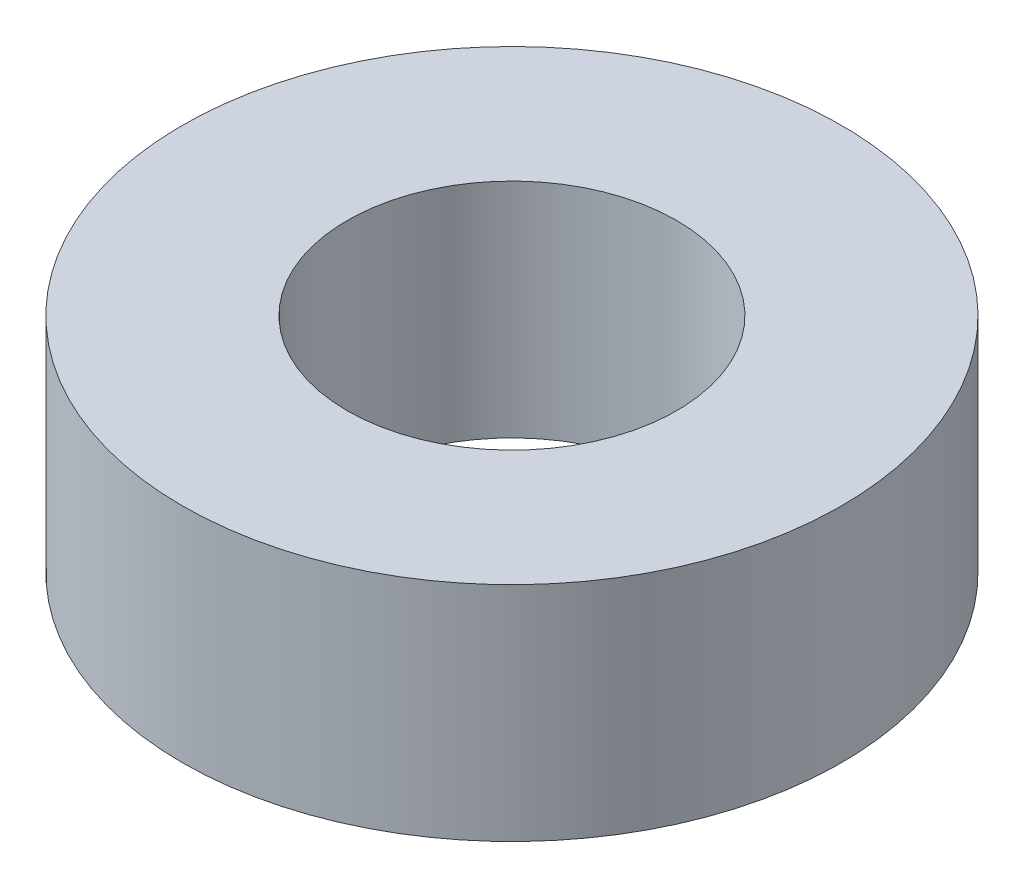
ISO-10303-21;
HEADER;
FILE_DESCRIPTION(('STEP AP214'),'2;1');
FILE_NAME('part.step','',(''),(''),'','','');
FILE_SCHEMA(('AUTOMOTIVE_DESIGN { 1 0 10303 214 1 1 1 1 }'));
ENDSEC;
DATA;
#1=APPLICATION_CONTEXT('core data for automotive mechanical design processes');
#2=APPLICATION_PROTOCOL_DEFINITION('international standard','automotive_design',2000,#1);
#3=PRODUCT_CONTEXT('',#1,'mechanical');
#4=PRODUCT('Part','Part','',(#3));
#5=PRODUCT_RELATED_PRODUCT_CATEGORY('part','',(#4));
#6=PRODUCT_DEFINITION_FORMATION('','',#4);
#7=PRODUCT_DEFINITION_CONTEXT('part definition',#1,'design');
#8=PRODUCT_DEFINITION('design','',#6,#7);
#9=PRODUCT_DEFINITION_SHAPE('','',#8);
#10=(LENGTH_UNIT() NAMED_UNIT(*) SI_UNIT(.MILLI.,.METRE.));
#11=(NAMED_UNIT(*) PLANE_ANGLE_UNIT() SI_UNIT($,.RADIAN.));
#12=(NAMED_UNIT(*) SI_UNIT($,.STERADIAN.) SOLID_ANGLE_UNIT());
#13=UNCERTAINTY_MEASURE_WITH_UNIT(LENGTH_MEASURE(1.E-05),#10,'distance_accuracy_value','');
#14=(GEOMETRIC_REPRESENTATION_CONTEXT(3) GLOBAL_UNCERTAINTY_ASSIGNED_CONTEXT((#13)) GLOBAL_UNIT_ASSIGNED_CONTEXT((#10,
#11,#12)) REPRESENTATION_CONTEXT('',''));
#15=CARTESIAN_POINT('',(0.,0.,0.));
#16=DIRECTION('',(0.,0.,1.));
#17=DIRECTION('',(1.,0.,0.));
#18=AXIS2_PLACEMENT_3D('',#15,#16,#17);
#19=CARTESIAN_POINT('',(0.,27.,0.));
#20=DIRECTION('',(0.,-1.,0.));
#21=DIRECTION('',(0.,0.,-1.));
#22=AXIS2_PLACEMENT_3D('',#19,#20,#21);
#23=CYLINDRICAL_SURFACE('',#22,40.);
#24=CARTESIAN_POINT('',(0.,27.,0.));
#25=DIRECTION('',(0.,1.,0.));
#26=DIRECTION('',(0.,0.,1.));
#27=AXIS2_PLACEMENT_3D('',#24,#25,#26);
#28=CIRCLE('',#27,40.);
#29=CARTESIAN_POINT('',(0.,27.,40.));
#30=VERTEX_POINT('',#29);
#31=EDGE_CURVE('E10',#30,#30,#28,.T.);
#32=ORIENTED_EDGE('',*,*,#31,.F.);
#33=EDGE_LOOP('',(#32));
#34=FACE_BOUND('',#33,.T.);
#35=CARTESIAN_POINT('',(0.,0.,0.));
#36=DIRECTION('',(0.,1.,0.));
#37=DIRECTION('',(0.,0.,1.));
#38=AXIS2_PLACEMENT_3D('',#35,#36,#37);
#39=CIRCLE('',#38,40.);
#40=CARTESIAN_POINT('',(0.,0.,40.));
#41=VERTEX_POINT('',#40);
#42=EDGE_CURVE('E37',#41,#41,#39,.T.);
#43=ORIENTED_EDGE('',*,*,#42,.T.);
#44=EDGE_LOOP('',(#43));
#45=FACE_BOUND('',#44,.T.);
#46=ADVANCED_FACE('F40',(#34,#45),#23,.T.);
#47=CARTESIAN_POINT('',(0.,27.,0.));
#48=DIRECTION('',(0.,1.,0.));
#49=DIRECTION('',(0.,0.,1.));
#50=AXIS2_PLACEMENT_3D('',#47,#48,#49);
#51=PLANE('',#50);
#52=CARTESIAN_POINT('',(0.,27.,0.));
#53=DIRECTION('',(0.,1.,0.));
#54=DIRECTION('',(0.,0.,1.));
#55=AXIS2_PLACEMENT_3D('',#52,#53,#54);
#56=CIRCLE('',#55,20.);
#57=CARTESIAN_POINT('',(0.,27.,20.));
#58=VERTEX_POINT('',#57);
#59=EDGE_CURVE('E50',#58,#58,#56,.T.);
#60=ORIENTED_EDGE('',*,*,#59,.F.);
#61=EDGE_LOOP('',(#60));
#62=FACE_BOUND('',#61,.T.);
#63=ORIENTED_EDGE('',*,*,#31,.T.);
#64=EDGE_LOOP('',(#63));
#65=FACE_BOUND('',#64,.T.);
#66=ADVANCED_FACE('F59',(#62,#65),#51,.T.);
#67=CARTESIAN_POINT('',(0.,0.,0.));
#68=DIRECTION('',(0.,1.,0.));
#69=DIRECTION('',(0.,0.,1.));
#70=AXIS2_PLACEMENT_3D('',#67,#68,#69);
#71=PLANE('',#70);
#72=CARTESIAN_POINT('',(0.,0.,0.));
#73=DIRECTION('',(0.,1.,0.));
#74=DIRECTION('',(0.,0.,1.));
#75=AXIS2_PLACEMENT_3D('',#72,#73,#74);
#76=CIRCLE('',#75,20.);
#77=CARTESIAN_POINT('',(0.,0.,20.));
#78=VERTEX_POINT('',#77);
#79=EDGE_CURVE('E47',#78,#78,#76,.T.);
#80=ORIENTED_EDGE('',*,*,#79,.T.);
#81=EDGE_LOOP('',(#80));
#82=FACE_BOUND('',#81,.T.);
#83=ORIENTED_EDGE('',*,*,#42,.F.);
#84=EDGE_LOOP('',(#83));
#85=FACE_BOUND('',#84,.T.);
#86=ADVANCED_FACE('F58',(#82,#85),#71,.F.);
#87=CARTESIAN_POINT('',(0.,27.,0.));
#88=DIRECTION('',(0.,-1.,0.));
#89=DIRECTION('',(0.,0.,-1.));
#90=AXIS2_PLACEMENT_3D('',#87,#88,#89);
#91=CYLINDRICAL_SURFACE('',#90,20.);
#92=ORIENTED_EDGE('',*,*,#59,.T.);
#93=EDGE_LOOP('',(#92));
#94=FACE_BOUND('',#93,.T.);
#95=ORIENTED_EDGE('',*,*,#79,.F.);
#96=EDGE_LOOP('',(#95));
#97=FACE_BOUND('',#96,.T.);
#98=ADVANCED_FACE('F54',(#94,#97),#91,.F.);
#99=CLOSED_SHELL('',(#46,#66,#86,#98));
#100=MANIFOLD_SOLID_BREP('B2',#99);
#101=ADVANCED_BREP_SHAPE_REPRESENTATION('',(#18,#100),#14);
#102=SHAPE_DEFINITION_REPRESENTATION(#9,#101);
ENDSEC;
END-ISO-10303-21;
